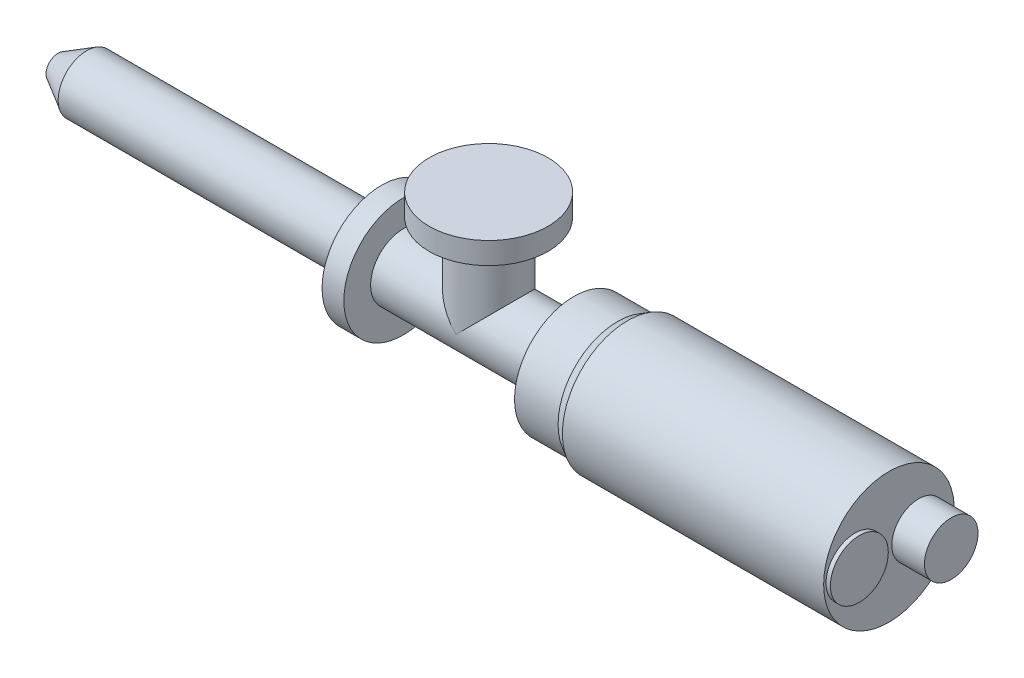
ISO-10303-21;
HEADER;
FILE_DESCRIPTION(('STEP AP214'),'2;1');
FILE_NAME('part.step','',(''),(''),'','','');
FILE_SCHEMA(('AUTOMOTIVE_DESIGN { 1 0 10303 214 1 1 1 1 }'));
ENDSEC;
DATA;
#1=APPLICATION_CONTEXT('core data for automotive mechanical design processes');
#2=APPLICATION_PROTOCOL_DEFINITION('international standard','automotive_design',2000,#1);
#3=PRODUCT_CONTEXT('',#1,'mechanical');
#4=PRODUCT('Part','Part','',(#3));
#5=PRODUCT_RELATED_PRODUCT_CATEGORY('part','',(#4));
#6=PRODUCT_DEFINITION_FORMATION('','',#4);
#7=PRODUCT_DEFINITION_CONTEXT('part definition',#1,'design');
#8=PRODUCT_DEFINITION('design','',#6,#7);
#9=PRODUCT_DEFINITION_SHAPE('','',#8);
#10=(LENGTH_UNIT() NAMED_UNIT(*) SI_UNIT(.MILLI.,.METRE.));
#11=(NAMED_UNIT(*) PLANE_ANGLE_UNIT() SI_UNIT($,.RADIAN.));
#12=(NAMED_UNIT(*) SI_UNIT($,.STERADIAN.) SOLID_ANGLE_UNIT());
#13=UNCERTAINTY_MEASURE_WITH_UNIT(LENGTH_MEASURE(1.E-05),#10,'distance_accuracy_value','');
#14=(GEOMETRIC_REPRESENTATION_CONTEXT(3) GLOBAL_UNCERTAINTY_ASSIGNED_CONTEXT((#13)) GLOBAL_UNIT_ASSIGNED_CONTEXT((#10,
#11,#12)) REPRESENTATION_CONTEXT('',''));
#15=CARTESIAN_POINT('',(0.,0.,0.));
#16=DIRECTION('',(0.,0.,1.));
#17=DIRECTION('',(1.,0.,0.));
#18=AXIS2_PLACEMENT_3D('',#15,#16,#17);
#19=CARTESIAN_POINT('',(484.729202219154,38.1,0.));
#20=DIRECTION('',(-1.,0.,0.));
#21=DIRECTION('',(0.,0.,1.));
#22=AXIS2_PLACEMENT_3D('',#19,#20,#21);
#23=PLANE('',#22);
#24=CARTESIAN_POINT('',(484.729202219154,0.,-17.272));
#25=DIRECTION('',(-1.,0.,0.));
#26=DIRECTION('',(0.,0.,1.));
#27=AXIS2_PLACEMENT_3D('',#24,#25,#26);
#28=CIRCLE('',#27,15.621);
#29=CARTESIAN_POINT('',(484.729202219154,0.,-1.65100000000001));
#30=VERTEX_POINT('',#29);
#31=EDGE_CURVE('E38',#30,#30,#28,.F.);
#32=ORIENTED_EDGE('',*,*,#31,.F.);
#33=EDGE_LOOP('',(#32));
#34=FACE_BOUND('',#33,.T.);
#35=CARTESIAN_POINT('',(484.729202219154,0.,0.));
#36=DIRECTION('',(-1.,0.,0.));
#37=DIRECTION('',(0.,0.,1.));
#38=AXIS2_PLACEMENT_3D('',#35,#36,#37);
#39=CIRCLE('',#38,38.1);
#40=CARTESIAN_POINT('',(484.729202219154,0.,38.1));
#41=VERTEX_POINT('',#40);
#42=EDGE_CURVE('E72',#41,#41,#39,.T.);
#43=ORIENTED_EDGE('',*,*,#42,.F.);
#44=EDGE_LOOP('',(#43));
#45=FACE_BOUND('',#44,.T.);
#46=CARTESIAN_POINT('',(484.729202219154,0.,19.812));
#47=DIRECTION('',(-1.,0.,0.));
#48=DIRECTION('',(0.,0.,1.));
#49=AXIS2_PLACEMENT_3D('',#46,#47,#48);
#50=CIRCLE('',#49,16.891);
#51=CARTESIAN_POINT('',(484.729202219154,0.,36.703));
#52=VERTEX_POINT('',#51);
#53=EDGE_CURVE('E11',#52,#52,#50,.F.);
#54=ORIENTED_EDGE('',*,*,#53,.F.);
#55=EDGE_LOOP('',(#54));
#56=FACE_BOUND('',#55,.T.);
#57=ADVANCED_FACE('F30',(#34,#45,#56),#23,.F.);
#58=CARTESIAN_POINT('',(251.206,62.484,0.));
#59=DIRECTION('',(0.,-1.,0.));
#60=DIRECTION('',(0.,0.,-1.));
#61=AXIS2_PLACEMENT_3D('',#58,#59,#60);
#62=CYLINDRICAL_SURFACE('',#61,19.05);
#63=CARTESIAN_POINT('',(251.206,0.,0.));
#64=DIRECTION('',(-0.707106781186548,0.707106781186547,0.));
#65=DIRECTION('',(-0.707106781186548,-0.707106781186547,0.));
#66=AXIS2_PLACEMENT_3D('',#63,#64,#65);
#67=ELLIPSE('',#66,26.9407683632075,19.05);
#68=CARTESIAN_POINT('',(251.206,0.,19.05));
#69=VERTEX_POINT('',#68);
#70=CARTESIAN_POINT('',(251.206,0.,-19.05));
#71=VERTEX_POINT('',#70);
#72=EDGE_CURVE('E44',#69,#71,#67,.T.);
#73=ORIENTED_EDGE('',*,*,#72,.T.);
#74=CARTESIAN_POINT('',(251.206,0.,0.));
#75=DIRECTION('',(-0.707106781186548,-0.707106781186547,0.));
#76=DIRECTION('',(-0.707106781186548,0.707106781186547,0.));
#77=AXIS2_PLACEMENT_3D('',#74,#75,#76);
#78=ELLIPSE('',#77,26.9407683632075,19.05);
#79=EDGE_CURVE('E46',#71,#69,#78,.F.);
#80=ORIENTED_EDGE('',*,*,#79,.T.);
#81=EDGE_LOOP('',(#73,#80));
#82=FACE_BOUND('',#81,.T.);
#83=CARTESIAN_POINT('',(251.206,49.784,0.));
#84=DIRECTION('',(0.,1.,0.));
#85=DIRECTION('',(0.,0.,1.));
#86=AXIS2_PLACEMENT_3D('',#83,#84,#85);
#87=CIRCLE('',#86,19.05);
#88=CARTESIAN_POINT('',(251.206,49.784,19.05));
#89=VERTEX_POINT('',#88);
#90=EDGE_CURVE('E49',#89,#89,#87,.T.);
#91=ORIENTED_EDGE('',*,*,#90,.F.);
#92=EDGE_LOOP('',(#91));
#93=FACE_BOUND('',#92,.T.);
#94=ADVANCED_FACE('F51',(#82,#93),#62,.T.);
#95=CARTESIAN_POINT('',(0.,0.,0.));
#96=DIRECTION('',(-1.,0.,0.));
#97=DIRECTION('',(0.,0.,1.));
#98=AXIS2_PLACEMENT_3D('',#95,#96,#97);
#99=CYLINDRICAL_SURFACE('',#98,19.05);
#100=CARTESIAN_POINT('',(300.99,0.,0.));
#101=DIRECTION('',(-1.,0.,0.));
#102=DIRECTION('',(0.,0.,1.));
#103=AXIS2_PLACEMENT_3D('',#100,#101,#102);
#104=CIRCLE('',#103,19.05);
#105=CARTESIAN_POINT('',(300.99,0.,19.05));
#106=VERTEX_POINT('',#105);
#107=EDGE_CURVE('E166',#106,#106,#104,.T.);
#108=ORIENTED_EDGE('',*,*,#107,.T.);
#109=EDGE_LOOP('',(#108));
#110=FACE_BOUND('',#109,.T.);
#111=CARTESIAN_POINT('',(201.422,0.,0.));
#112=DIRECTION('',(-1.,0.,0.));
#113=DIRECTION('',(0.,0.,1.));
#114=AXIS2_PLACEMENT_3D('',#111,#112,#113);
#115=CIRCLE('',#114,19.05);
#116=CARTESIAN_POINT('',(201.422,0.,19.05));
#117=VERTEX_POINT('',#116);
#118=EDGE_CURVE('E163',#117,#117,#115,.T.);
#119=ORIENTED_EDGE('',*,*,#118,.F.);
#120=EDGE_LOOP('',(#119));
#121=FACE_BOUND('',#120,.T.);
#122=ORIENTED_EDGE('',*,*,#79,.F.);
#123=ORIENTED_EDGE('',*,*,#72,.F.);
#124=EDGE_LOOP('',(#122,#123));
#125=FACE_BOUND('',#124,.T.);
#126=ADVANCED_FACE('F47',(#110,#121,#125),#99,.T.);
#127=CARTESIAN_POINT('',(0.,0.,0.));
#128=DIRECTION('',(1.,0.,0.));
#129=DIRECTION('',(0.,0.,-1.));
#130=AXIS2_PLACEMENT_3D('',#127,#128,#129);
#131=PLANE('',#130);
#132=CARTESIAN_POINT('',(0.,0.,0.));
#133=DIRECTION('',(-1.,0.,0.));
#134=DIRECTION('',(0.,0.,1.));
#135=AXIS2_PLACEMENT_3D('',#132,#133,#134);
#136=CIRCLE('',#135,6.985);
#137=CARTESIAN_POINT('',(0.,0.,6.985));
#138=VERTEX_POINT('',#137);
#139=EDGE_CURVE('E53',#138,#138,#136,.T.);
#140=ORIENTED_EDGE('',*,*,#139,.T.);
#141=EDGE_LOOP('',(#140));
#142=FACE_BOUND('',#141,.T.);
#143=ADVANCED_FACE('F32',(#142),#131,.F.);
#144=CARTESIAN_POINT('',(16.761748485167,0.,0.));
#145=DIRECTION('',(1.,0.,0.));
#146=DIRECTION('',(0.,0.,-1.));
#147=AXIS2_PLACEMENT_3D('',#144,#145,#146);
#148=CONICAL_SURFACE('',#147,16.6624,0.5235987755983);
#149=ORIENTED_EDGE('',*,*,#139,.F.);
#150=EDGE_LOOP('',(#149));
#151=FACE_BOUND('',#150,.T.);
#152=CARTESIAN_POINT('',(16.761748485167,0.,0.));
#153=DIRECTION('',(-1.,0.,0.));
#154=DIRECTION('',(0.,0.,1.));
#155=AXIS2_PLACEMENT_3D('',#152,#153,#154);
#156=CIRCLE('',#155,16.6624);
#157=CARTESIAN_POINT('',(16.761748485167,0.,16.6624));
#158=VERTEX_POINT('',#157);
#159=EDGE_CURVE('E56',#158,#158,#156,.T.);
#160=ORIENTED_EDGE('',*,*,#159,.T.);
#161=EDGE_LOOP('',(#160));
#162=FACE_BOUND('',#161,.T.);
#163=ADVANCED_FACE('F141',(#151,#162),#148,.T.);
#164=CARTESIAN_POINT('',(0.,0.,0.));
#165=DIRECTION('',(-1.,0.,0.));
#166=DIRECTION('',(0.,0.,1.));
#167=AXIS2_PLACEMENT_3D('',#164,#165,#166);
#168=CYLINDRICAL_SURFACE('',#167,16.6624);
#169=ORIENTED_EDGE('',*,*,#159,.F.);
#170=EDGE_LOOP('',(#169));
#171=FACE_BOUND('',#170,.T.);
#172=CARTESIAN_POINT('',(188.722,0.,0.));
#173=DIRECTION('',(-1.,0.,0.));
#174=DIRECTION('',(0.,0.,1.));
#175=AXIS2_PLACEMENT_3D('',#172,#173,#174);
#176=CIRCLE('',#175,16.6624);
#177=CARTESIAN_POINT('',(188.722,0.,16.6624));
#178=VERTEX_POINT('',#177);
#179=EDGE_CURVE('E153',#178,#178,#176,.T.);
#180=ORIENTED_EDGE('',*,*,#179,.T.);
#181=EDGE_LOOP('',(#180));
#182=FACE_BOUND('',#181,.T.);
#183=ADVANCED_FACE('F138',(#171,#182),#168,.T.);
#184=CARTESIAN_POINT('',(188.722,16.6624,0.));
#185=DIRECTION('',(1.,0.,0.));
#186=DIRECTION('',(0.,0.,-1.));
#187=AXIS2_PLACEMENT_3D('',#184,#185,#186);
#188=PLANE('',#187);
#189=ORIENTED_EDGE('',*,*,#179,.F.);
#190=EDGE_LOOP('',(#189));
#191=FACE_BOUND('',#190,.T.);
#192=CARTESIAN_POINT('',(188.722,0.,0.));
#193=DIRECTION('',(-1.,0.,0.));
#194=DIRECTION('',(0.,0.,1.));
#195=AXIS2_PLACEMENT_3D('',#192,#193,#194);
#196=CIRCLE('',#195,34.671);
#197=CARTESIAN_POINT('',(188.722,0.,34.671));
#198=VERTEX_POINT('',#197);
#199=EDGE_CURVE('E155',#198,#198,#196,.T.);
#200=ORIENTED_EDGE('',*,*,#199,.T.);
#201=EDGE_LOOP('',(#200));
#202=FACE_BOUND('',#201,.T.);
#203=ADVANCED_FACE('F134',(#191,#202),#188,.F.);
#204=CARTESIAN_POINT('',(0.,0.,0.));
#205=DIRECTION('',(-1.,0.,0.));
#206=DIRECTION('',(0.,0.,1.));
#207=AXIS2_PLACEMENT_3D('',#204,#205,#206);
#208=CYLINDRICAL_SURFACE('',#207,34.671);
#209=ORIENTED_EDGE('',*,*,#199,.F.);
#210=EDGE_LOOP('',(#209));
#211=FACE_BOUND('',#210,.T.);
#212=CARTESIAN_POINT('',(201.422,0.,0.));
#213=DIRECTION('',(-1.,0.,0.));
#214=DIRECTION('',(0.,0.,1.));
#215=AXIS2_PLACEMENT_3D('',#212,#213,#214);
#216=CIRCLE('',#215,34.671);
#217=CARTESIAN_POINT('',(201.422,0.,34.671));
#218=VERTEX_POINT('',#217);
#219=EDGE_CURVE('E160',#218,#218,#216,.T.);
#220=ORIENTED_EDGE('',*,*,#219,.T.);
#221=EDGE_LOOP('',(#220));
#222=FACE_BOUND('',#221,.T.);
#223=ADVANCED_FACE('F130',(#211,#222),#208,.T.);
#224=CARTESIAN_POINT('',(201.422,34.671,0.));
#225=DIRECTION('',(-1.,0.,0.));
#226=DIRECTION('',(0.,0.,1.));
#227=AXIS2_PLACEMENT_3D('',#224,#225,#226);
#228=PLANE('',#227);
#229=ORIENTED_EDGE('',*,*,#219,.F.);
#230=EDGE_LOOP('',(#229));
#231=FACE_BOUND('',#230,.T.);
#232=ORIENTED_EDGE('',*,*,#118,.T.);
#233=EDGE_LOOP('',(#232));
#234=FACE_BOUND('',#233,.T.);
#235=ADVANCED_FACE('F123',(#231,#234),#228,.F.);
#236=CARTESIAN_POINT('',(300.99,19.05,0.));
#237=DIRECTION('',(1.,0.,0.));
#238=DIRECTION('',(0.,0.,-1.));
#239=AXIS2_PLACEMENT_3D('',#236,#237,#238);
#240=PLANE('',#239);
#241=ORIENTED_EDGE('',*,*,#107,.F.);
#242=EDGE_LOOP('',(#241));
#243=FACE_BOUND('',#242,.T.);
#244=CARTESIAN_POINT('',(300.99,0.,0.));
#245=DIRECTION('',(-1.,0.,0.));
#246=DIRECTION('',(0.,0.,1.));
#247=AXIS2_PLACEMENT_3D('',#244,#245,#246);
#248=CIRCLE('',#247,34.671);
#249=CARTESIAN_POINT('',(300.99,0.,34.671));
#250=VERTEX_POINT('',#249);
#251=EDGE_CURVE('E169',#250,#250,#248,.T.);
#252=ORIENTED_EDGE('',*,*,#251,.T.);
#253=EDGE_LOOP('',(#252));
#254=FACE_BOUND('',#253,.T.);
#255=ADVANCED_FACE('F119',(#243,#254),#240,.F.);
#256=CARTESIAN_POINT('',(0.,0.,0.));
#257=DIRECTION('',(-1.,0.,0.));
#258=DIRECTION('',(0.,0.,1.));
#259=AXIS2_PLACEMENT_3D('',#256,#257,#258);
#260=CYLINDRICAL_SURFACE('',#259,34.671);
#261=ORIENTED_EDGE('',*,*,#251,.F.);
#262=EDGE_LOOP('',(#261));
#263=FACE_BOUND('',#262,.T.);
#264=CARTESIAN_POINT('',(326.39,0.,0.));
#265=DIRECTION('',(-1.,0.,0.));
#266=DIRECTION('',(0.,0.,1.));
#267=AXIS2_PLACEMENT_3D('',#264,#265,#266);
#268=CIRCLE('',#267,34.671);
#269=CARTESIAN_POINT('',(326.39,0.,34.671));
#270=VERTEX_POINT('',#269);
#271=EDGE_CURVE('E172',#270,#270,#268,.T.);
#272=ORIENTED_EDGE('',*,*,#271,.T.);
#273=EDGE_LOOP('',(#272));
#274=FACE_BOUND('',#273,.T.);
#275=ADVANCED_FACE('F115',(#263,#274),#260,.T.);
#276=CARTESIAN_POINT('',(332.329202219154,0.,0.));
#277=DIRECTION('',(1.,0.,0.));
#278=DIRECTION('',(0.,0.,-1.));
#279=AXIS2_PLACEMENT_3D('',#276,#277,#278);
#280=CONICAL_SURFACE('',#279,38.1,0.5235987755983);
#281=ORIENTED_EDGE('',*,*,#271,.F.);
#282=EDGE_LOOP('',(#281));
#283=FACE_BOUND('',#282,.T.);
#284=CARTESIAN_POINT('',(332.329202219154,0.,0.));
#285=DIRECTION('',(-1.,0.,0.));
#286=DIRECTION('',(0.,0.,1.));
#287=AXIS2_PLACEMENT_3D('',#284,#285,#286);
#288=CIRCLE('',#287,38.1);
#289=CARTESIAN_POINT('',(332.329202219154,0.,38.1));
#290=VERTEX_POINT('',#289);
#291=EDGE_CURVE('E175',#290,#290,#288,.T.);
#292=ORIENTED_EDGE('',*,*,#291,.T.);
#293=EDGE_LOOP('',(#292));
#294=FACE_BOUND('',#293,.T.);
#295=ADVANCED_FACE('F111',(#283,#294),#280,.T.);
#296=CARTESIAN_POINT('',(0.,0.,0.));
#297=DIRECTION('',(-1.,0.,0.));
#298=DIRECTION('',(0.,0.,1.));
#299=AXIS2_PLACEMENT_3D('',#296,#297,#298);
#300=CYLINDRICAL_SURFACE('',#299,38.1);
#301=ORIENTED_EDGE('',*,*,#291,.F.);
#302=EDGE_LOOP('',(#301));
#303=FACE_BOUND('',#302,.T.);
#304=ORIENTED_EDGE('',*,*,#42,.T.);
#305=EDGE_LOOP('',(#304));
#306=FACE_BOUND('',#305,.T.);
#307=ADVANCED_FACE('F99',(#303,#306),#300,.T.);
#308=CARTESIAN_POINT('',(251.206,49.784,0.));
#309=DIRECTION('',(0.,1.,0.));
#310=DIRECTION('',(0.,0.,1.));
#311=AXIS2_PLACEMENT_3D('',#308,#309,#310);
#312=PLANE('',#311);
#313=CARTESIAN_POINT('',(251.206,49.784,0.));
#314=DIRECTION('',(0.,1.,0.));
#315=DIRECTION('',(0.,0.,1.));
#316=AXIS2_PLACEMENT_3D('',#313,#314,#315);
#317=CIRCLE('',#316,34.671);
#318=CARTESIAN_POINT('',(251.206,49.784,34.671));
#319=VERTEX_POINT('',#318);
#320=EDGE_CURVE('E179',#319,#319,#317,.T.);
#321=ORIENTED_EDGE('',*,*,#320,.F.);
#322=EDGE_LOOP('',(#321));
#323=FACE_BOUND('',#322,.T.);
#324=ORIENTED_EDGE('',*,*,#90,.T.);
#325=EDGE_LOOP('',(#324));
#326=FACE_BOUND('',#325,.T.);
#327=ADVANCED_FACE('F95',(#323,#326),#312,.F.);
#328=CARTESIAN_POINT('',(251.206,49.784,0.));
#329=DIRECTION('',(0.,1.,0.));
#330=DIRECTION('',(0.,0.,1.));
#331=AXIS2_PLACEMENT_3D('',#328,#329,#330);
#332=CYLINDRICAL_SURFACE('',#331,34.671);
#333=ORIENTED_EDGE('',*,*,#320,.T.);
#334=EDGE_LOOP('',(#333));
#335=FACE_BOUND('',#334,.T.);
#336=CARTESIAN_POINT('',(251.206,62.484,0.));
#337=DIRECTION('',(0.,1.,0.));
#338=DIRECTION('',(0.,0.,1.));
#339=AXIS2_PLACEMENT_3D('',#336,#337,#338);
#340=CIRCLE('',#339,34.671);
#341=CARTESIAN_POINT('',(251.206,62.484,34.671));
#342=VERTEX_POINT('',#341);
#343=EDGE_CURVE('E180',#342,#342,#340,.T.);
#344=ORIENTED_EDGE('',*,*,#343,.F.);
#345=EDGE_LOOP('',(#344));
#346=FACE_BOUND('',#345,.T.);
#347=ADVANCED_FACE('F98',(#335,#346),#332,.T.);
#348=CARTESIAN_POINT('',(251.206,62.484,0.));
#349=DIRECTION('',(0.,1.,0.));
#350=DIRECTION('',(0.,0.,1.));
#351=AXIS2_PLACEMENT_3D('',#348,#349,#350);
#352=PLANE('',#351);
#353=ORIENTED_EDGE('',*,*,#343,.T.);
#354=EDGE_LOOP('',(#353));
#355=FACE_BOUND('',#354,.T.);
#356=ADVANCED_FACE('F93',(#355),#352,.T.);
#357=CARTESIAN_POINT('',(503.779202219154,0.,-17.272));
#358=DIRECTION('',(-1.,0.,0.));
#359=DIRECTION('',(0.,0.,1.));
#360=AXIS2_PLACEMENT_3D('',#357,#358,#359);
#361=CYLINDRICAL_SURFACE('',#360,15.621);
#362=CARTESIAN_POINT('',(503.779202219154,0.,-17.272));
#363=DIRECTION('',(1.,0.,0.));
#364=DIRECTION('',(0.,0.,-1.));
#365=AXIS2_PLACEMENT_3D('',#362,#363,#364);
#366=CIRCLE('',#365,15.621);
#367=CARTESIAN_POINT('',(503.779202219154,0.,-32.893));
#368=VERTEX_POINT('',#367);
#369=EDGE_CURVE('E183',#368,#368,#366,.T.);
#370=ORIENTED_EDGE('',*,*,#369,.F.);
#371=EDGE_LOOP('',(#370));
#372=FACE_BOUND('',#371,.T.);
#373=ORIENTED_EDGE('',*,*,#31,.T.);
#374=EDGE_LOOP('',(#373));
#375=FACE_BOUND('',#374,.T.);
#376=ADVANCED_FACE('F64',(#372,#375),#361,.T.);
#377=CARTESIAN_POINT('',(503.779202219154,0.,-17.272));
#378=DIRECTION('',(1.,0.,0.));
#379=DIRECTION('',(0.,0.,-1.));
#380=AXIS2_PLACEMENT_3D('',#377,#378,#379);
#381=PLANE('',#380);
#382=ORIENTED_EDGE('',*,*,#369,.T.);
#383=EDGE_LOOP('',(#382));
#384=FACE_BOUND('',#383,.T.);
#385=ADVANCED_FACE('F78',(#384),#381,.T.);
#386=CARTESIAN_POINT('',(487.269202219154,0.,19.812));
#387=DIRECTION('',(-1.,0.,0.));
#388=DIRECTION('',(0.,0.,1.));
#389=AXIS2_PLACEMENT_3D('',#386,#387,#388);
#390=CYLINDRICAL_SURFACE('',#389,16.891);
#391=CARTESIAN_POINT('',(487.269202219154,0.,19.812));
#392=DIRECTION('',(1.,0.,0.));
#393=DIRECTION('',(0.,0.,-1.));
#394=AXIS2_PLACEMENT_3D('',#391,#392,#393);
#395=CIRCLE('',#394,16.891);
#396=CARTESIAN_POINT('',(487.269202219154,0.,2.921));
#397=VERTEX_POINT('',#396);
#398=EDGE_CURVE('E188',#397,#397,#395,.T.);
#399=ORIENTED_EDGE('',*,*,#398,.F.);
#400=EDGE_LOOP('',(#399));
#401=FACE_BOUND('',#400,.T.);
#402=ORIENTED_EDGE('',*,*,#53,.T.);
#403=EDGE_LOOP('',(#402));
#404=FACE_BOUND('',#403,.T.);
#405=ADVANCED_FACE('F75',(#401,#404),#390,.T.);
#406=CARTESIAN_POINT('',(487.269202219154,0.,19.812));
#407=DIRECTION('',(1.,0.,0.));
#408=DIRECTION('',(0.,0.,-1.));
#409=AXIS2_PLACEMENT_3D('',#406,#407,#408);
#410=PLANE('',#409);
#411=ORIENTED_EDGE('',*,*,#398,.T.);
#412=EDGE_LOOP('',(#411));
#413=FACE_BOUND('',#412,.T.);
#414=ADVANCED_FACE('F77',(#413),#410,.T.);
#415=CLOSED_SHELL('',(#57,#94,#126,#143,#163,#183,#203,#223,#235,#255,#275,#295,#307,#327,#347,
#356,#376,#385,#405,#414));
#416=MANIFOLD_SOLID_BREP('B2',#415);
#417=ADVANCED_BREP_SHAPE_REPRESENTATION('',(#18,#416),#14);
#418=SHAPE_DEFINITION_REPRESENTATION(#9,#417);
ENDSEC;
END-ISO-10303-21;
